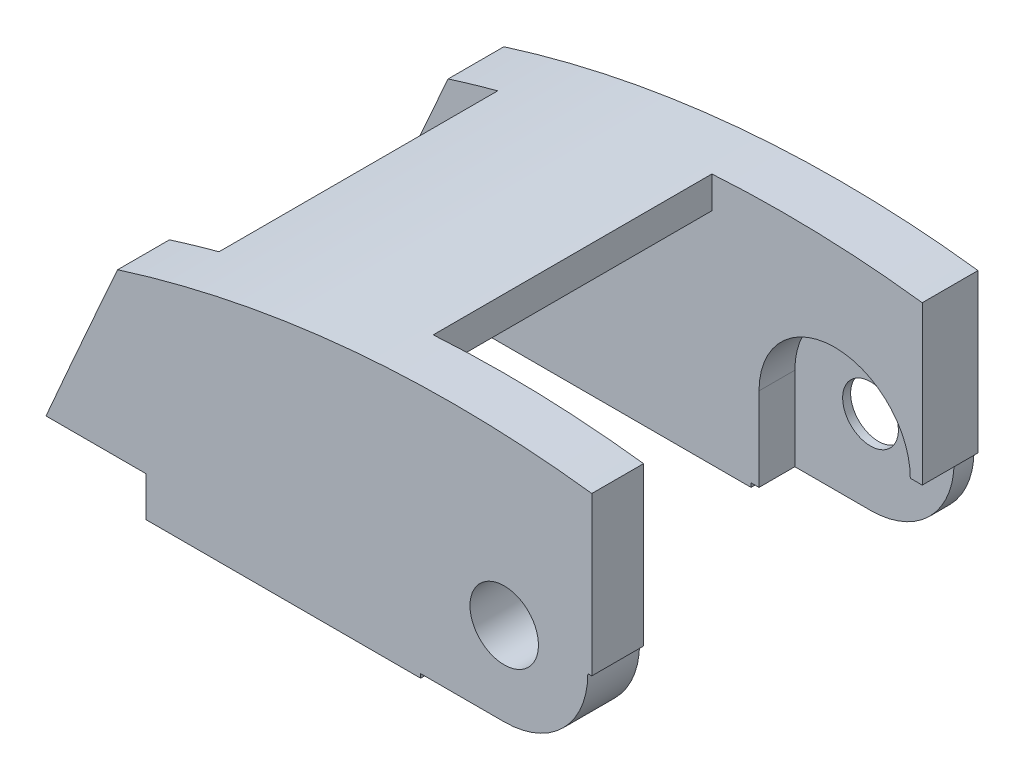
ISO-10303-21;
HEADER;
FILE_DESCRIPTION(('STEP AP214'),'2;1');
FILE_NAME('part.step','',(''),(''),'','','');
FILE_SCHEMA(('AUTOMOTIVE_DESIGN { 1 0 10303 214 1 1 1 1 }'));
ENDSEC;
DATA;
#1=APPLICATION_CONTEXT('core data for automotive mechanical design processes');
#2=APPLICATION_PROTOCOL_DEFINITION('international standard','automotive_design',2000,#1);
#3=PRODUCT_CONTEXT('',#1,'mechanical');
#4=PRODUCT('Part','Part','',(#3));
#5=PRODUCT_RELATED_PRODUCT_CATEGORY('part','',(#4));
#6=PRODUCT_DEFINITION_FORMATION('','',#4);
#7=PRODUCT_DEFINITION_CONTEXT('part definition',#1,'design');
#8=PRODUCT_DEFINITION('design','',#6,#7);
#9=PRODUCT_DEFINITION_SHAPE('','',#8);
#10=(LENGTH_UNIT() NAMED_UNIT(*) SI_UNIT(.MILLI.,.METRE.));
#11=(NAMED_UNIT(*) PLANE_ANGLE_UNIT() SI_UNIT($,.RADIAN.));
#12=(NAMED_UNIT(*) SI_UNIT($,.STERADIAN.) SOLID_ANGLE_UNIT());
#13=UNCERTAINTY_MEASURE_WITH_UNIT(LENGTH_MEASURE(1.E-05),#10,'distance_accuracy_value','');
#14=(GEOMETRIC_REPRESENTATION_CONTEXT(3) GLOBAL_UNCERTAINTY_ASSIGNED_CONTEXT((#13)) GLOBAL_UNIT_ASSIGNED_CONTEXT((#10,
#11,#12)) REPRESENTATION_CONTEXT('',''));
#15=CARTESIAN_POINT('',(0.,0.,0.));
#16=DIRECTION('',(0.,0.,1.));
#17=DIRECTION('',(1.,0.,0.));
#18=AXIS2_PLACEMENT_3D('',#15,#16,#17);
#19=CARTESIAN_POINT('',(0.,0.,21.75));
#20=DIRECTION('',(0.,0.,-1.));
#21=DIRECTION('',(-1.,0.,0.));
#22=AXIS2_PLACEMENT_3D('',#19,#20,#21);
#23=CYLINDRICAL_SURFACE('',#22,3.5);
#24=CARTESIAN_POINT('',(0.,0.,2.5));
#25=DIRECTION('',(0.,0.,1.));
#26=DIRECTION('',(0.,-1.,0.));
#27=AXIS2_PLACEMENT_3D('',#24,#25,#26);
#28=CIRCLE('',#27,3.5);
#29=CARTESIAN_POINT('',(0.,-3.5,2.5));
#30=VERTEX_POINT('',#29);
#31=EDGE_CURVE('E310',#30,#30,#28,.T.);
#32=ORIENTED_EDGE('',*,*,#31,.T.);
#33=EDGE_LOOP('',(#32));
#34=FACE_BOUND('',#33,.T.);
#35=CARTESIAN_POINT('',(0.,0.,1.5));
#36=DIRECTION('',(0.,0.,-1.));
#37=DIRECTION('',(-1.,0.,0.));
#38=AXIS2_PLACEMENT_3D('',#35,#36,#37);
#39=CIRCLE('',#38,3.5);
#40=CARTESIAN_POINT('',(-3.5,0.,1.5));
#41=VERTEX_POINT('',#40);
#42=EDGE_CURVE('E53',#41,#41,#39,.F.);
#43=ORIENTED_EDGE('',*,*,#42,.F.);
#44=EDGE_LOOP('',(#43));
#45=FACE_BOUND('',#44,.T.);
#46=ADVANCED_FACE('F49',(#34,#45),#23,.F.);
#47=CARTESIAN_POINT('',(12.,-12.,7.));
#48=DIRECTION('',(0.,0.,-1.));
#49=DIRECTION('',(0.,-1.,0.));
#50=AXIS2_PLACEMENT_3D('',#47,#48,#49);
#51=PLANE('',#50);
#52=CARTESIAN_POINT('',(0.,0.,7.));
#53=DIRECTION('',(0.,0.,-1.));
#54=DIRECTION('',(0.,1.,0.));
#55=AXIS2_PLACEMENT_3D('',#52,#53,#54);
#56=CIRCLE('',#55,9.5);
#57=CARTESIAN_POINT('',(-9.5,0.,7.));
#58=VERTEX_POINT('',#57);
#59=CARTESIAN_POINT('',(9.5,0.,7.));
#60=VERTEX_POINT('',#59);
#61=EDGE_CURVE('E537',#58,#60,#56,.T.);
#62=ORIENTED_EDGE('',*,*,#61,.T.);
#63=DIRECTION('',(-1.,0.,0.));
#64=VECTOR('',#63,1.);
#65=CARTESIAN_POINT('',(12.,0.,7.));
#66=LINE('',#65,#64);
#67=CARTESIAN_POINT('',(11.,0.,7.00000000000003));
#68=VERTEX_POINT('',#67);
#69=EDGE_CURVE('E382',#68,#60,#66,.T.);
#70=ORIENTED_EDGE('',*,*,#69,.F.);
#71=DIRECTION('',(0.,-1.,0.));
#72=VECTOR('',#71,1.);
#73=CARTESIAN_POINT('',(11.,-12.,7.));
#74=LINE('',#73,#72);
#75=CARTESIAN_POINT('',(11.,19.84,7.00000000000001));
#76=VERTEX_POINT('',#75);
#77=EDGE_CURVE('E532',#76,#68,#74,.T.);
#78=ORIENTED_EDGE('',*,*,#77,.F.);
#79=CARTESIAN_POINT('',(-6.37755228058483,-118.72612320149,7.00000000000001));
#80=DIRECTION('',(0.,0.,-1.));
#81=DIRECTION('',(-1.,0.,0.));
#82=AXIS2_PLACEMENT_3D('',#79,#80,#81);
#83=CIRCLE('',#82,139.651529967828);
#84=CARTESIAN_POINT('',(-15.4186813659914,20.6324352268174,7.00000000000001));
#85=VERTEX_POINT('',#84);
#86=EDGE_CURVE('E425',#76,#85,#83,.F.);
#87=ORIENTED_EDGE('',*,*,#86,.T.);
#88=DIRECTION('',(0.,1.,0.));
#89=VECTOR('',#88,1.);
#90=CARTESIAN_POINT('',(-15.4186813659914,25.0924741347079,7.));
#91=LINE('',#90,#89);
#92=CARTESIAN_POINT('',(-15.4186813659914,16.6302624928661,7.));
#93=VERTEX_POINT('',#92);
#94=EDGE_CURVE('E400',#93,#85,#91,.T.);
#95=ORIENTED_EDGE('',*,*,#94,.F.);
#96=CARTESIAN_POINT('',(-6.54760474938378,-90.7897246312211,6.99999999999999));
#97=DIRECTION('',(0.,0.,-1.));
#98=DIRECTION('',(0.,1.,0.));
#99=AXIS2_PLACEMENT_3D('',#96,#97,#98);
#100=CIRCLE('',#99,107.785665253209);
#101=CARTESIAN_POINT('',(-42.3185543882278,10.887159644469,7.));
#102=VERTEX_POINT('',#101);
#103=EDGE_CURVE('E449',#93,#102,#100,.F.);
#104=ORIENTED_EDGE('',*,*,#103,.T.);
#105=DIRECTION('',(0.,-1.,0.));
#106=VECTOR('',#105,1.);
#107=CARTESIAN_POINT('',(-42.3185543882278,23.1968454989127,7.));
#108=LINE('',#107,#106);
#109=CARTESIAN_POINT('',(-42.3185543882278,16.2212524300997,7.00000000000001));
#110=VERTEX_POINT('',#109);
#111=EDGE_CURVE('E395',#110,#102,#108,.T.);
#112=ORIENTED_EDGE('',*,*,#111,.F.);
#113=CARTESIAN_POINT('',(-6.37755228058483,-118.72612320149,7.00000000000001));
#114=DIRECTION('',(0.,0.,-1.));
#115=DIRECTION('',(-1.,0.,0.));
#116=AXIS2_PLACEMENT_3D('',#113,#114,#115);
#117=CIRCLE('',#116,139.651529967828);
#118=CARTESIAN_POINT('',(-48.5440000000004,14.4074206899005,7.));
#119=VERTEX_POINT('',#118);
#120=EDGE_CURVE('E414',#110,#119,#117,.F.);
#121=ORIENTED_EDGE('',*,*,#120,.T.);
#122=CARTESIAN_POINT('',(1474.51463993777,-669.474162441972,7.));
#123=DIRECTION('',(0.,0.,-1.));
#124=DIRECTION('',(-1.,0.,0.));
#125=AXIS2_PLACEMENT_3D('',#122,#123,#124);
#126=CIRCLE('',#125,1669.55132908098);
#127=CARTESIAN_POINT('',(-57.544,-6.00000000000001,7.));
#128=VERTEX_POINT('',#127);
#129=EDGE_CURVE('E550',#128,#119,#126,.T.);
#130=ORIENTED_EDGE('',*,*,#129,.F.);
#131=DIRECTION('',(-1.,0.,0.));
#132=VECTOR('',#131,1.);
#133=CARTESIAN_POINT('',(12.,-6.00000000000001,7.));
#134=LINE('',#133,#132);
#135=CARTESIAN_POINT('',(-45.,-6.00000000000001,7.));
#136=VERTEX_POINT('',#135);
#137=EDGE_CURVE('E497',#136,#128,#134,.T.);
#138=ORIENTED_EDGE('',*,*,#137,.F.);
#139=DIRECTION('',(0.,1.,0.));
#140=VECTOR('',#139,1.);
#141=CARTESIAN_POINT('',(-45.,-12.,7.));
#142=LINE('',#141,#140);
#143=CARTESIAN_POINT('',(-45.,-11.,6.99999999999999));
#144=VERTEX_POINT('',#143);
#145=EDGE_CURVE('E500',#144,#136,#142,.T.);
#146=ORIENTED_EDGE('',*,*,#145,.F.);
#147=DIRECTION('',(-1.,0.,0.));
#148=VECTOR('',#147,1.);
#149=CARTESIAN_POINT('',(0.,-11.,7.));
#150=LINE('',#149,#148);
#151=CARTESIAN_POINT('',(-10.5,-11.,7.00000000000001));
#152=VERTEX_POINT('',#151);
#153=EDGE_CURVE('E514',#152,#144,#150,.T.);
#154=ORIENTED_EDGE('',*,*,#153,.F.);
#155=DIRECTION('',(0.,-1.,0.));
#156=VECTOR('',#155,1.);
#157=CARTESIAN_POINT('',(-10.5,-12.,7.));
#158=LINE('',#157,#156);
#159=CARTESIAN_POINT('',(-10.5,-10.5,7.00000000000001));
#160=VERTEX_POINT('',#159);
#161=EDGE_CURVE('E389',#160,#152,#158,.T.);
#162=ORIENTED_EDGE('',*,*,#161,.F.);
#163=DIRECTION('',(-1.,0.,0.));
#164=VECTOR('',#163,1.);
#165=CARTESIAN_POINT('',(12.,-10.5,7.));
#166=LINE('',#165,#164);
#167=CARTESIAN_POINT('',(-9.5,-10.5,7.00000000000001));
#168=VERTEX_POINT('',#167);
#169=EDGE_CURVE('E392',#168,#160,#166,.T.);
#170=ORIENTED_EDGE('',*,*,#169,.F.);
#171=DIRECTION('',(0.,1.,0.));
#172=VECTOR('',#171,1.);
#173=CARTESIAN_POINT('',(-9.5,-12.,7.));
#174=LINE('',#173,#172);
#175=EDGE_CURVE('E322',#168,#58,#174,.T.);
#176=ORIENTED_EDGE('',*,*,#175,.T.);
#177=EDGE_LOOP('',(#62,#70,#78,#87,#95,#104,#112,#121,#130,#138,#146,#154,#162,#170,#176));
#178=FACE_BOUND('',#177,.T.);
#179=ADVANCED_FACE('F583',(#178),#51,.F.);
#180=CARTESIAN_POINT('',(0.,0.,0.));
#181=DIRECTION('',(0.,0.,-1.));
#182=DIRECTION('',(1.,0.,0.));
#183=AXIS2_PLACEMENT_3D('',#180,#181,#182);
#184=PLANE('',#183);
#185=CARTESIAN_POINT('',(0.,0.,0.));
#186=DIRECTION('',(0.,0.,-1.));
#187=DIRECTION('',(-1.,0.,0.));
#188=AXIS2_PLACEMENT_3D('',#185,#186,#187);
#189=CIRCLE('',#188,6.);
#190=CARTESIAN_POINT('',(0.,6.,0.));
#191=VERTEX_POINT('',#190);
#192=CARTESIAN_POINT('',(0.,-6.,0.));
#193=VERTEX_POINT('',#192);
#194=EDGE_CURVE('E67',#191,#193,#189,.T.);
#195=ORIENTED_EDGE('',*,*,#194,.F.);
#196=DIRECTION('',(1.,0.,0.));
#197=VECTOR('',#196,1.);
#198=CARTESIAN_POINT('',(0.,6.,0.));
#199=LINE('',#198,#197);
#200=CARTESIAN_POINT('',(-25.,6.,0.));
#201=VERTEX_POINT('',#200);
#202=EDGE_CURVE('E279',#201,#191,#199,.T.);
#203=ORIENTED_EDGE('',*,*,#202,.F.);
#204=DIRECTION('',(0.,1.,0.));
#205=VECTOR('',#204,1.);
#206=CARTESIAN_POINT('',(-25.,6.,0.));
#207=LINE('',#206,#205);
#208=CARTESIAN_POINT('',(-25.,-6.,0.));
#209=VERTEX_POINT('',#208);
#210=EDGE_CURVE('E283',#209,#201,#207,.T.);
#211=ORIENTED_EDGE('',*,*,#210,.F.);
#212=DIRECTION('',(-1.,0.,0.));
#213=VECTOR('',#212,1.);
#214=CARTESIAN_POINT('',(0.,-6.,0.));
#215=LINE('',#214,#213);
#216=EDGE_CURVE('E292',#193,#209,#215,.T.);
#217=ORIENTED_EDGE('',*,*,#216,.F.);
#218=EDGE_LOOP('',(#195,#203,#211,#217));
#219=FACE_BOUND('',#218,.T.);
#220=DIRECTION('',(-1.,0.,0.));
#221=VECTOR('',#220,1.);
#222=CARTESIAN_POINT('',(0.,-10.5,0.));
#223=LINE('',#222,#221);
#224=CARTESIAN_POINT('',(0.,-10.5,0.));
#225=VERTEX_POINT('',#224);
#226=CARTESIAN_POINT('',(-10.5,-10.5,0.));
#227=VERTEX_POINT('',#226);
#228=EDGE_CURVE('E335',#225,#227,#223,.T.);
#229=ORIENTED_EDGE('',*,*,#228,.T.);
#230=DIRECTION('',(0.,-1.,0.));
#231=VECTOR('',#230,1.);
#232=CARTESIAN_POINT('',(-10.5,0.,0.));
#233=LINE('',#232,#231);
#234=CARTESIAN_POINT('',(-10.5,-11.,0.));
#235=VERTEX_POINT('',#234);
#236=EDGE_CURVE('E353',#227,#235,#233,.T.);
#237=ORIENTED_EDGE('',*,*,#236,.T.);
#238=DIRECTION('',(-1.,0.,0.));
#239=VECTOR('',#238,1.);
#240=CARTESIAN_POINT('',(0.,-11.,0.));
#241=LINE('',#240,#239);
#242=CARTESIAN_POINT('',(-45.,-11.,0.));
#243=VERTEX_POINT('',#242);
#244=EDGE_CURVE('E513',#235,#243,#241,.T.);
#245=ORIENTED_EDGE('',*,*,#244,.T.);
#246=DIRECTION('',(0.,-1.,0.));
#247=VECTOR('',#246,1.);
#248=CARTESIAN_POINT('',(-45.,-11.,0.));
#249=LINE('',#248,#247);
#250=CARTESIAN_POINT('',(-45.,-6.00000000000001,0.));
#251=VERTEX_POINT('',#250);
#252=EDGE_CURVE('E474',#251,#243,#249,.T.);
#253=ORIENTED_EDGE('',*,*,#252,.F.);
#254=DIRECTION('',(1.,0.,0.));
#255=VECTOR('',#254,1.);
#256=CARTESIAN_POINT('',(-55.,-6.,0.));
#257=LINE('',#256,#255);
#258=CARTESIAN_POINT('',(-57.544,-6.00000000000001,0.));
#259=VERTEX_POINT('',#258);
#260=EDGE_CURVE('E471',#259,#251,#257,.T.);
#261=ORIENTED_EDGE('',*,*,#260,.F.);
#262=CARTESIAN_POINT('',(1474.51463993777,-669.474162441972,0.));
#263=DIRECTION('',(0.,0.,-1.));
#264=DIRECTION('',(-1.,0.,0.));
#265=AXIS2_PLACEMENT_3D('',#262,#263,#264);
#266=CIRCLE('',#265,1669.55132908098);
#267=CARTESIAN_POINT('',(-48.544,14.4074206899005,0.));
#268=VERTEX_POINT('',#267);
#269=EDGE_CURVE('E432',#268,#259,#266,.F.);
#270=ORIENTED_EDGE('',*,*,#269,.F.);
#271=CARTESIAN_POINT('',(-6.37755228058483,-118.72612320149,0.));
#272=DIRECTION('',(0.,0.,-1.));
#273=DIRECTION('',(-1.,0.,0.));
#274=AXIS2_PLACEMENT_3D('',#271,#272,#273);
#275=CIRCLE('',#274,139.651529967828);
#276=CARTESIAN_POINT('',(11.,19.84,0.));
#277=VERTEX_POINT('',#276);
#278=EDGE_CURVE('E466',#268,#277,#275,.T.);
#279=ORIENTED_EDGE('',*,*,#278,.T.);
#280=DIRECTION('',(0.,-1.,0.));
#281=VECTOR('',#280,1.);
#282=CARTESIAN_POINT('',(11.,0.,0.));
#283=LINE('',#282,#281);
#284=CARTESIAN_POINT('',(11.,0.,0.));
#285=VERTEX_POINT('',#284);
#286=EDGE_CURVE('E517',#277,#285,#283,.T.);
#287=ORIENTED_EDGE('',*,*,#286,.T.);
#288=DIRECTION('',(-1.,0.,0.));
#289=VECTOR('',#288,1.);
#290=CARTESIAN_POINT('',(0.,0.,0.));
#291=LINE('',#290,#289);
#292=CARTESIAN_POINT('',(10.5,0.,0.));
#293=VERTEX_POINT('',#292);
#294=EDGE_CURVE('E349',#285,#293,#291,.T.);
#295=ORIENTED_EDGE('',*,*,#294,.T.);
#296=CARTESIAN_POINT('',(0.,0.,0.));
#297=DIRECTION('',(0.,0.,-1.));
#298=DIRECTION('',(-1.,0.,0.));
#299=AXIS2_PLACEMENT_3D('',#296,#297,#298);
#300=CIRCLE('',#299,10.5);
#301=EDGE_CURVE('E345',#293,#225,#300,.T.);
#302=ORIENTED_EDGE('',*,*,#301,.T.);
#303=EDGE_LOOP('',(#229,#237,#245,#253,#261,#270,#279,#287,#295,#302));
#304=FACE_BOUND('',#303,.T.);
#305=ADVANCED_FACE('F590',(#219,#304),#184,.T.);
#306=CARTESIAN_POINT('',(0.,0.,48.5));
#307=DIRECTION('',(0.,0.,1.));
#308=DIRECTION('',(-1.,0.,0.));
#309=AXIS2_PLACEMENT_3D('',#306,#307,#308);
#310=PLANE('',#309);
#311=CARTESIAN_POINT('',(0.,0.,48.5));
#312=DIRECTION('',(0.,0.,-1.));
#313=DIRECTION('',(-1.,0.,0.));
#314=AXIS2_PLACEMENT_3D('',#311,#312,#313);
#315=CIRCLE('',#314,4.3);
#316=CARTESIAN_POINT('',(-4.3,0.,48.5));
#317=VERTEX_POINT('',#316);
#318=EDGE_CURVE('E326',#317,#317,#315,.T.);
#319=ORIENTED_EDGE('',*,*,#318,.T.);
#320=EDGE_LOOP('',(#319));
#321=FACE_BOUND('',#320,.T.);
#322=DIRECTION('',(-1.,0.,0.));
#323=VECTOR('',#322,1.);
#324=CARTESIAN_POINT('',(0.,-11.,48.5));
#325=LINE('',#324,#323);
#326=CARTESIAN_POINT('',(-10.5,-11.,48.5));
#327=VERTEX_POINT('',#326);
#328=CARTESIAN_POINT('',(-45.,-11.,48.5));
#329=VERTEX_POINT('',#328);
#330=EDGE_CURVE('E510',#327,#329,#325,.T.);
#331=ORIENTED_EDGE('',*,*,#330,.F.);
#332=DIRECTION('',(0.,-1.,0.));
#333=VECTOR('',#332,1.);
#334=CARTESIAN_POINT('',(-10.5,0.,48.5));
#335=LINE('',#334,#333);
#336=CARTESIAN_POINT('',(-10.5,-10.5,48.5));
#337=VERTEX_POINT('',#336);
#338=EDGE_CURVE('E338',#337,#327,#335,.T.);
#339=ORIENTED_EDGE('',*,*,#338,.F.);
#340=DIRECTION('',(-1.,0.,0.));
#341=VECTOR('',#340,1.);
#342=CARTESIAN_POINT('',(0.,-10.5,48.5));
#343=LINE('',#342,#341);
#344=CARTESIAN_POINT('',(0.,-10.5,48.5));
#345=VERTEX_POINT('',#344);
#346=EDGE_CURVE('E341',#345,#337,#343,.T.);
#347=ORIENTED_EDGE('',*,*,#346,.F.);
#348=CARTESIAN_POINT('',(0.,0.,48.5));
#349=DIRECTION('',(0.,0.,-1.));
#350=DIRECTION('',(-1.,0.,0.));
#351=AXIS2_PLACEMENT_3D('',#348,#349,#350);
#352=CIRCLE('',#351,10.5);
#353=CARTESIAN_POINT('',(10.5,0.,48.5));
#354=VERTEX_POINT('',#353);
#355=EDGE_CURVE('E331',#354,#345,#352,.T.);
#356=ORIENTED_EDGE('',*,*,#355,.F.);
#357=DIRECTION('',(-1.,0.,0.));
#358=VECTOR('',#357,1.);
#359=CARTESIAN_POINT('',(0.,0.,48.5));
#360=LINE('',#359,#358);
#361=CARTESIAN_POINT('',(11.,0.,48.5));
#362=VERTEX_POINT('',#361);
#363=EDGE_CURVE('E334',#362,#354,#360,.T.);
#364=ORIENTED_EDGE('',*,*,#363,.F.);
#365=DIRECTION('',(0.,-1.,0.));
#366=VECTOR('',#365,1.);
#367=CARTESIAN_POINT('',(11.,0.,48.5));
#368=LINE('',#367,#366);
#369=CARTESIAN_POINT('',(11.,19.84,48.5));
#370=VERTEX_POINT('',#369);
#371=EDGE_CURVE('E520',#370,#362,#368,.T.);
#372=ORIENTED_EDGE('',*,*,#371,.F.);
#373=CARTESIAN_POINT('',(-6.37755228058483,-118.72612320149,48.5));
#374=DIRECTION('',(0.,0.,1.));
#375=DIRECTION('',(1.,0.,0.));
#376=AXIS2_PLACEMENT_3D('',#373,#374,#375);
#377=CIRCLE('',#376,139.651529967828);
#378=CARTESIAN_POINT('',(-48.544,14.4074206899005,48.5));
#379=VERTEX_POINT('',#378);
#380=EDGE_CURVE('E463',#370,#379,#377,.T.);
#381=ORIENTED_EDGE('',*,*,#380,.T.);
#382=CARTESIAN_POINT('',(1474.51463993777,-669.474162441972,48.5));
#383=DIRECTION('',(0.,0.,-1.));
#384=DIRECTION('',(-1.,0.,0.));
#385=AXIS2_PLACEMENT_3D('',#382,#383,#384);
#386=CIRCLE('',#385,1669.55132908098);
#387=CARTESIAN_POINT('',(-57.544,-6.00000000000001,48.5));
#388=VERTEX_POINT('',#387);
#389=EDGE_CURVE('E436',#379,#388,#386,.F.);
#390=ORIENTED_EDGE('',*,*,#389,.T.);
#391=DIRECTION('',(1.,0.,0.));
#392=VECTOR('',#391,1.);
#393=CARTESIAN_POINT('',(-55.,-6.,48.5));
#394=LINE('',#393,#392);
#395=CARTESIAN_POINT('',(-45.,-6.00000000000001,48.5));
#396=VERTEX_POINT('',#395);
#397=EDGE_CURVE('E470',#388,#396,#394,.T.);
#398=ORIENTED_EDGE('',*,*,#397,.T.);
#399=DIRECTION('',(0.,-1.,0.));
#400=VECTOR('',#399,1.);
#401=CARTESIAN_POINT('',(-45.,-11.,48.5));
#402=LINE('',#401,#400);
#403=EDGE_CURVE('E475',#396,#329,#402,.T.);
#404=ORIENTED_EDGE('',*,*,#403,.T.);
#405=EDGE_LOOP('',(#331,#339,#347,#356,#364,#372,#381,#390,#398,#404));
#406=FACE_BOUND('',#405,.T.);
#407=ADVANCED_FACE('F660',(#321,#406),#310,.T.);
#408=CARTESIAN_POINT('',(0.,0.,42.));
#409=DIRECTION('',(0.,0.,-1.));
#410=DIRECTION('',(1.,0.,0.));
#411=AXIS2_PLACEMENT_3D('',#408,#409,#410);
#412=PLANE('',#411);
#413=CARTESIAN_POINT('',(0.,0.,42.));
#414=DIRECTION('',(0.,0.,-1.));
#415=DIRECTION('',(-1.,0.,0.));
#416=AXIS2_PLACEMENT_3D('',#413,#414,#415);
#417=CIRCLE('',#416,4.3);
#418=CARTESIAN_POINT('',(-4.3,0.,42.));
#419=VERTEX_POINT('',#418);
#420=EDGE_CURVE('E330',#419,#419,#417,.T.);
#421=ORIENTED_EDGE('',*,*,#420,.F.);
#422=EDGE_LOOP('',(#421));
#423=FACE_BOUND('',#422,.T.);
#424=DIRECTION('',(-1.,0.,0.));
#425=VECTOR('',#424,1.);
#426=CARTESIAN_POINT('',(0.,-10.5,42.));
#427=LINE('',#426,#425);
#428=CARTESIAN_POINT('',(0.,-10.5,42.));
#429=VERTEX_POINT('',#428);
#430=CARTESIAN_POINT('',(-10.5,-10.5,42.));
#431=VERTEX_POINT('',#430);
#432=EDGE_CURVE('E566',#429,#431,#427,.T.);
#433=ORIENTED_EDGE('',*,*,#432,.T.);
#434=DIRECTION('',(0.,-1.,0.));
#435=VECTOR('',#434,1.);
#436=CARTESIAN_POINT('',(-10.5,0.,42.));
#437=LINE('',#436,#435);
#438=CARTESIAN_POINT('',(-10.5,-11.,42.));
#439=VERTEX_POINT('',#438);
#440=EDGE_CURVE('E385',#431,#439,#437,.T.);
#441=ORIENTED_EDGE('',*,*,#440,.T.);
#442=DIRECTION('',(1.,0.,0.));
#443=VECTOR('',#442,1.);
#444=CARTESIAN_POINT('',(0.,-11.,42.));
#445=LINE('',#444,#443);
#446=CARTESIAN_POINT('',(-45.,-11.,42.));
#447=VERTEX_POINT('',#446);
#448=EDGE_CURVE('E506',#447,#439,#445,.T.);
#449=ORIENTED_EDGE('',*,*,#448,.F.);
#450=DIRECTION('',(0.,1.,0.));
#451=VECTOR('',#450,1.);
#452=CARTESIAN_POINT('',(-45.,0.,42.));
#453=LINE('',#452,#451);
#454=CARTESIAN_POINT('',(-45.,-6.00000000000001,42.));
#455=VERTEX_POINT('',#454);
#456=EDGE_CURVE('E541',#447,#455,#453,.T.);
#457=ORIENTED_EDGE('',*,*,#456,.T.);
#458=DIRECTION('',(-1.,0.,0.));
#459=VECTOR('',#458,1.);
#460=CARTESIAN_POINT('',(0.,-6.00000000000001,42.));
#461=LINE('',#460,#459);
#462=CARTESIAN_POINT('',(-57.544,-6.00000000000001,42.));
#463=VERTEX_POINT('',#462);
#464=EDGE_CURVE('E489',#455,#463,#461,.T.);
#465=ORIENTED_EDGE('',*,*,#464,.T.);
#466=CARTESIAN_POINT('',(1474.51463993777,-669.474162441972,42.));
#467=DIRECTION('',(0.,0.,-1.));
#468=DIRECTION('',(-1.,0.,0.));
#469=AXIS2_PLACEMENT_3D('',#466,#467,#468);
#470=CIRCLE('',#469,1669.55132908098);
#471=CARTESIAN_POINT('',(-48.5440000000004,14.4074206899005,42.));
#472=VERTEX_POINT('',#471);
#473=EDGE_CURVE('E547',#463,#472,#470,.T.);
#474=ORIENTED_EDGE('',*,*,#473,.T.);
#475=CARTESIAN_POINT('',(-6.37755228058483,-118.72612320149,42.));
#476=DIRECTION('',(0.,0.,-1.));
#477=DIRECTION('',(-1.,0.,0.));
#478=AXIS2_PLACEMENT_3D('',#475,#476,#477);
#479=CIRCLE('',#478,139.651529967828);
#480=CARTESIAN_POINT('',(-42.3185543882278,16.2212524300997,42.));
#481=VERTEX_POINT('',#480);
#482=EDGE_CURVE('E405',#481,#472,#479,.F.);
#483=ORIENTED_EDGE('',*,*,#482,.F.);
#484=DIRECTION('',(0.,-1.,0.));
#485=VECTOR('',#484,1.);
#486=CARTESIAN_POINT('',(-42.3185543882278,23.1968454989127,42.));
#487=LINE('',#486,#485);
#488=CARTESIAN_POINT('',(-42.3185543882278,10.887159644469,42.));
#489=VERTEX_POINT('',#488);
#490=EDGE_CURVE('E401',#481,#489,#487,.T.);
#491=ORIENTED_EDGE('',*,*,#490,.T.);
#492=CARTESIAN_POINT('',(-6.54760474938378,-90.7897246312211,42.));
#493=DIRECTION('',(0.,0.,-1.));
#494=DIRECTION('',(-1.,0.,0.));
#495=AXIS2_PLACEMENT_3D('',#492,#493,#494);
#496=CIRCLE('',#495,107.785665253209);
#497=CARTESIAN_POINT('',(-15.4186813659914,16.6302624928661,42.));
#498=VERTEX_POINT('',#497);
#499=EDGE_CURVE('E445',#498,#489,#496,.F.);
#500=ORIENTED_EDGE('',*,*,#499,.F.);
#501=DIRECTION('',(0.,1.,0.));
#502=VECTOR('',#501,1.);
#503=CARTESIAN_POINT('',(-15.4186813659914,25.0924741347079,42.));
#504=LINE('',#503,#502);
#505=CARTESIAN_POINT('',(-15.4186813659914,20.6324352268174,42.));
#506=VERTEX_POINT('',#505);
#507=EDGE_CURVE('E396',#498,#506,#504,.T.);
#508=ORIENTED_EDGE('',*,*,#507,.T.);
#509=CARTESIAN_POINT('',(-6.37755228058483,-118.72612320149,42.));
#510=DIRECTION('',(0.,0.,-1.));
#511=DIRECTION('',(-1.,0.,0.));
#512=AXIS2_PLACEMENT_3D('',#509,#510,#511);
#513=CIRCLE('',#512,139.651529967828);
#514=CARTESIAN_POINT('',(11.,19.84,42.));
#515=VERTEX_POINT('',#514);
#516=EDGE_CURVE('E421',#515,#506,#513,.F.);
#517=ORIENTED_EDGE('',*,*,#516,.F.);
#518=DIRECTION('',(0.,1.,0.));
#519=VECTOR('',#518,1.);
#520=CARTESIAN_POINT('',(11.,0.,42.));
#521=LINE('',#520,#519);
#522=CARTESIAN_POINT('',(11.,0.,42.));
#523=VERTEX_POINT('',#522);
#524=EDGE_CURVE('E503',#523,#515,#521,.T.);
#525=ORIENTED_EDGE('',*,*,#524,.F.);
#526=DIRECTION('',(-1.,0.,0.));
#527=VECTOR('',#526,1.);
#528=CARTESIAN_POINT('',(0.,0.,42.));
#529=LINE('',#528,#527);
#530=CARTESIAN_POINT('',(10.5,0.,42.));
#531=VERTEX_POINT('',#530);
#532=EDGE_CURVE('E364',#523,#531,#529,.T.);
#533=ORIENTED_EDGE('',*,*,#532,.T.);
#534=CARTESIAN_POINT('',(0.,0.,42.));
#535=DIRECTION('',(0.,0.,-1.));
#536=DIRECTION('',(-1.,0.,0.));
#537=AXIS2_PLACEMENT_3D('',#534,#535,#536);
#538=CIRCLE('',#537,10.5);
#539=EDGE_CURVE('E562',#531,#429,#538,.T.);
#540=ORIENTED_EDGE('',*,*,#539,.T.);
#541=EDGE_LOOP('',(#433,#441,#449,#457,#465,#474,#483,#491,#500,#508,#517,#525,#533,#540));
#542=FACE_BOUND('',#541,.T.);
#543=ADVANCED_FACE('F656',(#423,#542),#412,.T.);
#544=CARTESIAN_POINT('',(0.,-11.,7.));
#545=DIRECTION('',(0.,1.,0.));
#546=DIRECTION('',(-1.,0.,0.));
#547=AXIS2_PLACEMENT_3D('',#544,#545,#546);
#548=PLANE('',#547);
#549=DIRECTION('',(0.,0.,-1.));
#550=VECTOR('',#549,1.);
#551=CARTESIAN_POINT('',(-10.5,-11.,48.5));
#552=LINE('',#551,#550);
#553=EDGE_CURVE('E371',#327,#439,#552,.T.);
#554=ORIENTED_EDGE('',*,*,#553,.F.);
#555=ORIENTED_EDGE('',*,*,#330,.T.);
#556=DIRECTION('',(0.,0.,1.));
#557=VECTOR('',#556,1.);
#558=CARTESIAN_POINT('',(-45.,-11.,0.));
#559=LINE('',#558,#557);
#560=EDGE_CURVE('E490',#447,#329,#559,.T.);
#561=ORIENTED_EDGE('',*,*,#560,.F.);
#562=ORIENTED_EDGE('',*,*,#448,.T.);
#563=EDGE_LOOP('',(#554,#555,#561,#562));
#564=FACE_BOUND('',#563,.T.);
#565=ADVANCED_FACE('F659',(#564),#548,.F.);
#566=EDGE_CURVE('E374',#152,#235,#552,.T.);
#567=ORIENTED_EDGE('',*,*,#566,.F.);
#568=ORIENTED_EDGE('',*,*,#153,.T.);
#569=EDGE_CURVE('E485',#243,#144,#559,.T.);
#570=ORIENTED_EDGE('',*,*,#569,.F.);
#571=ORIENTED_EDGE('',*,*,#244,.F.);
#572=EDGE_LOOP('',(#567,#568,#570,#571));
#573=FACE_BOUND('',#572,.T.);
#574=ADVANCED_FACE('F664',(#573),#548,.F.);
#575=CARTESIAN_POINT('',(11.,0.,48.5));
#576=DIRECTION('',(-1.,0.,0.));
#577=DIRECTION('',(0.,0.,-1.));
#578=AXIS2_PLACEMENT_3D('',#575,#576,#577);
#579=PLANE('',#578);
#580=ORIENTED_EDGE('',*,*,#524,.T.);
#581=DIRECTION('',(0.,0.,-1.));
#582=VECTOR('',#581,1.);
#583=CARTESIAN_POINT('',(11.,19.84,214.866061332315));
#584=LINE('',#583,#582);
#585=EDGE_CURVE('E459',#370,#515,#584,.T.);
#586=ORIENTED_EDGE('',*,*,#585,.F.);
#587=ORIENTED_EDGE('',*,*,#371,.T.);
#588=DIRECTION('',(0.,0.,-1.));
#589=VECTOR('',#588,1.);
#590=CARTESIAN_POINT('',(11.,0.,48.5));
#591=LINE('',#590,#589);
#592=EDGE_CURVE('E528',#362,#523,#591,.T.);
#593=ORIENTED_EDGE('',*,*,#592,.T.);
#594=EDGE_LOOP('',(#580,#586,#587,#593));
#595=FACE_BOUND('',#594,.T.);
#596=ADVANCED_FACE('F670',(#595),#579,.F.);
#597=CARTESIAN_POINT('',(-55.,-6.,0.));
#598=DIRECTION('',(0.,1.,0.));
#599=DIRECTION('',(-1.,0.,0.));
#600=AXIS2_PLACEMENT_3D('',#597,#598,#599);
#601=PLANE('',#600);
#602=DIRECTION('',(0.,0.,-1.));
#603=VECTOR('',#602,1.);
#604=CARTESIAN_POINT('',(-57.544,-6.00000000000001,48.5));
#605=LINE('',#604,#603);
#606=EDGE_CURVE('E441',#388,#463,#605,.T.);
#607=ORIENTED_EDGE('',*,*,#606,.T.);
#608=ORIENTED_EDGE('',*,*,#464,.F.);
#609=DIRECTION('',(0.,0.,1.));
#610=VECTOR('',#609,1.);
#611=CARTESIAN_POINT('',(-45.,-6.00000000000001,0.));
#612=LINE('',#611,#610);
#613=EDGE_CURVE('E479',#455,#396,#612,.T.);
#614=ORIENTED_EDGE('',*,*,#613,.T.);
#615=ORIENTED_EDGE('',*,*,#397,.F.);
#616=EDGE_LOOP('',(#607,#608,#614,#615));
#617=FACE_BOUND('',#616,.T.);
#618=ADVANCED_FACE('F641',(#617),#601,.F.);
#619=CARTESIAN_POINT('',(-6.54760474938378,-90.7897246312211,48.5));
#620=DIRECTION('',(0.,0.,-1.));
#621=DIRECTION('',(-1.,0.,0.));
#622=AXIS2_PLACEMENT_3D('',#619,#620,#621);
#623=CYLINDRICAL_SURFACE('',#622,107.785665253209);
#624=ORIENTED_EDGE('',*,*,#103,.F.);
#625=DIRECTION('',(0.,0.,-1.));
#626=VECTOR('',#625,1.);
#627=CARTESIAN_POINT('',(-15.4186813659914,16.6302624928661,48.5));
#628=LINE('',#627,#626);
#629=EDGE_CURVE('E558',#93,#498,#628,.F.);
#630=ORIENTED_EDGE('',*,*,#629,.T.);
#631=ORIENTED_EDGE('',*,*,#499,.T.);
#632=DIRECTION('',(0.,0.,-1.));
#633=VECTOR('',#632,1.);
#634=CARTESIAN_POINT('',(-42.3185543882278,10.887159644469,48.5));
#635=LINE('',#634,#633);
#636=EDGE_CURVE('E554',#489,#102,#635,.T.);
#637=ORIENTED_EDGE('',*,*,#636,.T.);
#638=EDGE_LOOP('',(#624,#630,#631,#637));
#639=FACE_BOUND('',#638,.T.);
#640=ADVANCED_FACE('F638',(#639),#623,.F.);
#641=CARTESIAN_POINT('',(1474.51463993777,-669.474162441972,48.5));
#642=DIRECTION('',(0.,0.,-1.));
#643=DIRECTION('',(-1.,0.,0.));
#644=AXIS2_PLACEMENT_3D('',#641,#642,#643);
#645=CYLINDRICAL_SURFACE('',#644,1669.55132908098);
#646=ORIENTED_EDGE('',*,*,#473,.F.);
#647=ORIENTED_EDGE('',*,*,#606,.F.);
#648=ORIENTED_EDGE('',*,*,#389,.F.);
#649=DIRECTION('',(0.,0.,-1.));
#650=VECTOR('',#649,1.);
#651=CARTESIAN_POINT('',(-48.544,14.4074206899005,214.866061332315));
#652=LINE('',#651,#650);
#653=EDGE_CURVE('E454',#379,#472,#652,.T.);
#654=ORIENTED_EDGE('',*,*,#653,.T.);
#655=EDGE_LOOP('',(#646,#647,#648,#654));
#656=FACE_BOUND('',#655,.T.);
#657=ADVANCED_FACE('F637',(#656),#645,.T.);
#658=EDGE_CURVE('E458',#76,#277,#584,.T.);
#659=ORIENTED_EDGE('',*,*,#658,.F.);
#660=ORIENTED_EDGE('',*,*,#77,.T.);
#661=EDGE_CURVE('E524',#68,#285,#591,.T.);
#662=ORIENTED_EDGE('',*,*,#661,.T.);
#663=ORIENTED_EDGE('',*,*,#286,.F.);
#664=EDGE_LOOP('',(#659,#660,#662,#663));
#665=FACE_BOUND('',#664,.T.);
#666=ADVANCED_FACE('F666',(#665),#579,.F.);
#667=CARTESIAN_POINT('',(0.,0.,2.5));
#668=DIRECTION('',(0.,0.,1.));
#669=DIRECTION('',(0.,1.,0.));
#670=AXIS2_PLACEMENT_3D('',#667,#668,#669);
#671=PLANE('',#670);
#672=ORIENTED_EDGE('',*,*,#31,.F.);
#673=EDGE_LOOP('',(#672));
#674=FACE_BOUND('',#673,.T.);
#675=CARTESIAN_POINT('',(0.,0.,2.5));
#676=DIRECTION('',(0.,0.,-1.));
#677=DIRECTION('',(0.,1.,0.));
#678=AXIS2_PLACEMENT_3D('',#675,#676,#677);
#679=CIRCLE('',#678,9.5);
#680=CARTESIAN_POINT('',(-9.5,0.,2.5));
#681=VERTEX_POINT('',#680);
#682=CARTESIAN_POINT('',(9.5,0.,2.5));
#683=VERTEX_POINT('',#682);
#684=EDGE_CURVE('E536',#681,#683,#679,.T.);
#685=ORIENTED_EDGE('',*,*,#684,.F.);
#686=DIRECTION('',(0.,-1.,0.));
#687=VECTOR('',#686,1.);
#688=CARTESIAN_POINT('',(-9.5,0.,2.5));
#689=LINE('',#688,#687);
#690=CARTESIAN_POINT('',(-9.5,-10.5,2.5));
#691=VERTEX_POINT('',#690);
#692=EDGE_CURVE('E309',#681,#691,#689,.T.);
#693=ORIENTED_EDGE('',*,*,#692,.T.);
#694=DIRECTION('',(1.,0.,0.));
#695=VECTOR('',#694,1.);
#696=CARTESIAN_POINT('',(0.,-10.5,2.5));
#697=LINE('',#696,#695);
#698=CARTESIAN_POINT('',(0.,-10.5,2.50000000000002));
#699=VERTEX_POINT('',#698);
#700=EDGE_CURVE('E75',#691,#699,#697,.T.);
#701=ORIENTED_EDGE('',*,*,#700,.T.);
#702=CARTESIAN_POINT('',(0.,0.,2.5));
#703=DIRECTION('',(0.,0.,-1.));
#704=DIRECTION('',(-1.,0.,0.));
#705=AXIS2_PLACEMENT_3D('',#702,#703,#704);
#706=CIRCLE('',#705,10.5);
#707=CARTESIAN_POINT('',(10.5,0.,2.5));
#708=VERTEX_POINT('',#707);
#709=EDGE_CURVE('E59',#699,#708,#706,.F.);
#710=ORIENTED_EDGE('',*,*,#709,.T.);
#711=DIRECTION('',(-1.,0.,0.));
#712=VECTOR('',#711,1.);
#713=CARTESIAN_POINT('',(0.,0.,2.5));
#714=LINE('',#713,#712);
#715=EDGE_CURVE('E306',#708,#683,#714,.T.);
#716=ORIENTED_EDGE('',*,*,#715,.T.);
#717=EDGE_LOOP('',(#685,#693,#701,#710,#716));
#718=FACE_BOUND('',#717,.T.);
#719=ADVANCED_FACE('F51',(#674,#718),#671,.T.);
#720=CARTESIAN_POINT('',(0.,0.,2.5));
#721=DIRECTION('',(0.,0.,1.));
#722=DIRECTION('',(0.,1.,0.));
#723=AXIS2_PLACEMENT_3D('',#720,#721,#722);
#724=CYLINDRICAL_SURFACE('',#723,9.5);
#725=ORIENTED_EDGE('',*,*,#684,.T.);
#726=DIRECTION('',(0.,0.,1.));
#727=VECTOR('',#726,1.);
#728=CARTESIAN_POINT('',(9.5,0.,2.5));
#729=LINE('',#728,#727);
#730=EDGE_CURVE('E316',#683,#60,#729,.T.);
#731=ORIENTED_EDGE('',*,*,#730,.T.);
#732=ORIENTED_EDGE('',*,*,#61,.F.);
#733=DIRECTION('',(0.,0.,1.));
#734=VECTOR('',#733,1.);
#735=CARTESIAN_POINT('',(-9.5,0.,2.5));
#736=LINE('',#735,#734);
#737=EDGE_CURVE('E313',#681,#58,#736,.T.);
#738=ORIENTED_EDGE('',*,*,#737,.F.);
#739=EDGE_LOOP('',(#725,#731,#732,#738));
#740=FACE_BOUND('',#739,.T.);
#741=ADVANCED_FACE('F651',(#740),#724,.F.);
#742=CARTESIAN_POINT('',(-45.,-11.,0.));
#743=DIRECTION('',(1.,0.,0.));
#744=DIRECTION('',(0.,0.,1.));
#745=AXIS2_PLACEMENT_3D('',#742,#743,#744);
#746=PLANE('',#745);
#747=ORIENTED_EDGE('',*,*,#456,.F.);
#748=ORIENTED_EDGE('',*,*,#560,.T.);
#749=ORIENTED_EDGE('',*,*,#403,.F.);
#750=ORIENTED_EDGE('',*,*,#613,.F.);
#751=EDGE_LOOP('',(#747,#748,#749,#750));
#752=FACE_BOUND('',#751,.T.);
#753=ADVANCED_FACE('F647',(#752),#746,.F.);
#754=ORIENTED_EDGE('',*,*,#569,.T.);
#755=ORIENTED_EDGE('',*,*,#145,.T.);
#756=EDGE_CURVE('E491',#251,#136,#612,.T.);
#757=ORIENTED_EDGE('',*,*,#756,.F.);
#758=ORIENTED_EDGE('',*,*,#252,.T.);
#759=EDGE_LOOP('',(#754,#755,#757,#758));
#760=FACE_BOUND('',#759,.T.);
#761=ADVANCED_FACE('F650',(#760),#746,.F.);
#762=ORIENTED_EDGE('',*,*,#137,.T.);
#763=EDGE_CURVE('E440',#128,#259,#605,.T.);
#764=ORIENTED_EDGE('',*,*,#763,.T.);
#765=ORIENTED_EDGE('',*,*,#260,.T.);
#766=ORIENTED_EDGE('',*,*,#756,.T.);
#767=EDGE_LOOP('',(#762,#764,#765,#766));
#768=FACE_BOUND('',#767,.T.);
#769=ADVANCED_FACE('F645',(#768),#601,.F.);
#770=CARTESIAN_POINT('',(-6.37755228058483,-118.72612320149,214.866061332315));
#771=DIRECTION('',(0.,0.,-1.));
#772=DIRECTION('',(-1.,0.,0.));
#773=AXIS2_PLACEMENT_3D('',#770,#771,#772);
#774=CYLINDRICAL_SURFACE('',#773,139.651529967828);
#775=ORIENTED_EDGE('',*,*,#86,.F.);
#776=ORIENTED_EDGE('',*,*,#658,.T.);
#777=ORIENTED_EDGE('',*,*,#278,.F.);
#778=EDGE_CURVE('E453',#119,#268,#652,.T.);
#779=ORIENTED_EDGE('',*,*,#778,.F.);
#780=ORIENTED_EDGE('',*,*,#120,.F.);
#781=DIRECTION('',(0.,0.,-1.));
#782=VECTOR('',#781,1.);
#783=CARTESIAN_POINT('',(-42.3185543882278,16.2212524300997,214.866061332315));
#784=LINE('',#783,#782);
#785=EDGE_CURVE('E417',#110,#481,#784,.F.);
#786=ORIENTED_EDGE('',*,*,#785,.T.);
#787=ORIENTED_EDGE('',*,*,#482,.T.);
#788=ORIENTED_EDGE('',*,*,#653,.F.);
#789=ORIENTED_EDGE('',*,*,#380,.F.);
#790=ORIENTED_EDGE('',*,*,#585,.T.);
#791=ORIENTED_EDGE('',*,*,#516,.T.);
#792=DIRECTION('',(0.,0.,-1.));
#793=VECTOR('',#792,1.);
#794=CARTESIAN_POINT('',(-15.4186813659914,20.6324352268174,214.866061332315));
#795=LINE('',#794,#793);
#796=EDGE_CURVE('E428',#506,#85,#795,.T.);
#797=ORIENTED_EDGE('',*,*,#796,.T.);
#798=EDGE_LOOP('',(#775,#776,#777,#779,#780,#786,#787,#788,#789,#790,#791,#797));
#799=FACE_BOUND('',#798,.T.);
#800=ADVANCED_FACE('F635',(#799),#774,.T.);
#801=ORIENTED_EDGE('',*,*,#763,.F.);
#802=ORIENTED_EDGE('',*,*,#129,.T.);
#803=ORIENTED_EDGE('',*,*,#778,.T.);
#804=ORIENTED_EDGE('',*,*,#269,.T.);
#805=EDGE_LOOP('',(#801,#802,#803,#804));
#806=FACE_BOUND('',#805,.T.);
#807=ADVANCED_FACE('F631',(#806),#645,.T.);
#808=CARTESIAN_POINT('',(-42.3185543882278,23.1968454989127,7.));
#809=DIRECTION('',(-1.,0.,0.));
#810=DIRECTION('',(0.,0.,1.));
#811=AXIS2_PLACEMENT_3D('',#808,#809,#810);
#812=PLANE('',#811);
#813=ORIENTED_EDGE('',*,*,#111,.T.);
#814=ORIENTED_EDGE('',*,*,#636,.F.);
#815=ORIENTED_EDGE('',*,*,#490,.F.);
#816=ORIENTED_EDGE('',*,*,#785,.F.);
#817=EDGE_LOOP('',(#813,#814,#815,#816));
#818=FACE_BOUND('',#817,.T.);
#819=ADVANCED_FACE('F627',(#818),#812,.T.);
#820=CARTESIAN_POINT('',(-15.4186813659914,25.0924741347079,7.));
#821=DIRECTION('',(1.,0.,0.));
#822=DIRECTION('',(0.,0.,-1.));
#823=AXIS2_PLACEMENT_3D('',#820,#821,#822);
#824=PLANE('',#823);
#825=ORIENTED_EDGE('',*,*,#507,.F.);
#826=ORIENTED_EDGE('',*,*,#629,.F.);
#827=ORIENTED_EDGE('',*,*,#94,.T.);
#828=ORIENTED_EDGE('',*,*,#796,.F.);
#829=EDGE_LOOP('',(#825,#826,#827,#828));
#830=FACE_BOUND('',#829,.T.);
#831=ADVANCED_FACE('F624',(#830),#824,.T.);
#832=CARTESIAN_POINT('',(-10.5,0.,48.5));
#833=DIRECTION('',(1.,0.,0.));
#834=DIRECTION('',(0.,0.,-1.));
#835=AXIS2_PLACEMENT_3D('',#832,#833,#834);
#836=PLANE('',#835);
#837=ORIENTED_EDGE('',*,*,#161,.T.);
#838=ORIENTED_EDGE('',*,*,#566,.T.);
#839=ORIENTED_EDGE('',*,*,#236,.F.);
#840=DIRECTION('',(0.,0.,-1.));
#841=VECTOR('',#840,1.);
#842=CARTESIAN_POINT('',(-10.5,-10.5,48.5));
#843=LINE('',#842,#841);
#844=EDGE_CURVE('E370',#160,#227,#843,.T.);
#845=ORIENTED_EDGE('',*,*,#844,.F.);
#846=EDGE_LOOP('',(#837,#838,#839,#845));
#847=FACE_BOUND('',#846,.T.);
#848=ADVANCED_FACE('F615',(#847),#836,.T.);
#849=CARTESIAN_POINT('',(0.,-10.5,48.5));
#850=DIRECTION('',(0.,-1.,0.));
#851=DIRECTION('',(0.,0.,-1.));
#852=AXIS2_PLACEMENT_3D('',#849,#850,#851);
#853=PLANE('',#852);
#854=DIRECTION('',(0.,0.,-1.));
#855=VECTOR('',#854,1.);
#856=CARTESIAN_POINT('',(-9.5,-10.5,48.5));
#857=LINE('',#856,#855);
#858=EDGE_CURVE('E11',#168,#691,#857,.T.);
#859=ORIENTED_EDGE('',*,*,#858,.F.);
#860=ORIENTED_EDGE('',*,*,#169,.T.);
#861=ORIENTED_EDGE('',*,*,#844,.T.);
#862=ORIENTED_EDGE('',*,*,#228,.F.);
#863=DIRECTION('',(0.,0.,-1.));
#864=VECTOR('',#863,1.);
#865=CARTESIAN_POINT('',(0.,-10.5,48.5));
#866=LINE('',#865,#864);
#867=EDGE_CURVE('E365',#699,#225,#866,.T.);
#868=ORIENTED_EDGE('',*,*,#867,.F.);
#869=ORIENTED_EDGE('',*,*,#700,.F.);
#870=EDGE_LOOP('',(#859,#860,#861,#862,#868,#869));
#871=FACE_BOUND('',#870,.T.);
#872=ADVANCED_FACE('F611',(#871),#853,.T.);
#873=CARTESIAN_POINT('',(0.,0.,48.5));
#874=DIRECTION('',(0.,-1.,0.));
#875=DIRECTION('',(1.,0.,0.));
#876=AXIS2_PLACEMENT_3D('',#873,#874,#875);
#877=PLANE('',#876);
#878=ORIENTED_EDGE('',*,*,#294,.F.);
#879=ORIENTED_EDGE('',*,*,#661,.F.);
#880=ORIENTED_EDGE('',*,*,#69,.T.);
#881=ORIENTED_EDGE('',*,*,#730,.F.);
#882=ORIENTED_EDGE('',*,*,#715,.F.);
#883=DIRECTION('',(0.,0.,-1.));
#884=VECTOR('',#883,1.);
#885=CARTESIAN_POINT('',(10.5,0.,48.5));
#886=LINE('',#885,#884);
#887=EDGE_CURVE('E344',#708,#293,#886,.T.);
#888=ORIENTED_EDGE('',*,*,#887,.T.);
#889=EDGE_LOOP('',(#878,#879,#880,#881,#882,#888));
#890=FACE_BOUND('',#889,.T.);
#891=ADVANCED_FACE('F619',(#890),#877,.T.);
#892=CARTESIAN_POINT('',(0.,0.,48.5));
#893=DIRECTION('',(0.,0.,-1.));
#894=DIRECTION('',(-1.,0.,0.));
#895=AXIS2_PLACEMENT_3D('',#892,#893,#894);
#896=CYLINDRICAL_SURFACE('',#895,10.5);
#897=ORIENTED_EDGE('',*,*,#709,.F.);
#898=ORIENTED_EDGE('',*,*,#867,.T.);
#899=ORIENTED_EDGE('',*,*,#301,.F.);
#900=ORIENTED_EDGE('',*,*,#887,.F.);
#901=EDGE_LOOP('',(#897,#898,#899,#900));
#902=FACE_BOUND('',#901,.T.);
#903=ADVANCED_FACE('F622',(#902),#896,.T.);
#904=EDGE_CURVE('E375',#354,#531,#886,.T.);
#905=ORIENTED_EDGE('',*,*,#904,.F.);
#906=ORIENTED_EDGE('',*,*,#355,.T.);
#907=EDGE_CURVE('E360',#345,#429,#866,.T.);
#908=ORIENTED_EDGE('',*,*,#907,.T.);
#909=ORIENTED_EDGE('',*,*,#539,.F.);
#910=EDGE_LOOP('',(#905,#906,#908,#909));
#911=FACE_BOUND('',#910,.T.);
#912=ADVANCED_FACE('F609',(#911),#896,.T.);
#913=ORIENTED_EDGE('',*,*,#907,.F.);
#914=ORIENTED_EDGE('',*,*,#346,.T.);
#915=EDGE_CURVE('E366',#337,#431,#843,.T.);
#916=ORIENTED_EDGE('',*,*,#915,.T.);
#917=ORIENTED_EDGE('',*,*,#432,.F.);
#918=EDGE_LOOP('',(#913,#914,#916,#917));
#919=FACE_BOUND('',#918,.T.);
#920=ADVANCED_FACE('F605',(#919),#853,.T.);
#921=ORIENTED_EDGE('',*,*,#915,.F.);
#922=ORIENTED_EDGE('',*,*,#338,.T.);
#923=ORIENTED_EDGE('',*,*,#553,.T.);
#924=ORIENTED_EDGE('',*,*,#440,.F.);
#925=EDGE_LOOP('',(#921,#922,#923,#924));
#926=FACE_BOUND('',#925,.T.);
#927=ADVANCED_FACE('F608',(#926),#836,.T.);
#928=ORIENTED_EDGE('',*,*,#592,.F.);
#929=ORIENTED_EDGE('',*,*,#363,.T.);
#930=ORIENTED_EDGE('',*,*,#904,.T.);
#931=ORIENTED_EDGE('',*,*,#532,.F.);
#932=EDGE_LOOP('',(#928,#929,#930,#931));
#933=FACE_BOUND('',#932,.T.);
#934=ADVANCED_FACE('F603',(#933),#877,.T.);
#935=CARTESIAN_POINT('',(0.,0.,48.5));
#936=DIRECTION('',(0.,0.,-1.));
#937=DIRECTION('',(-1.,0.,0.));
#938=AXIS2_PLACEMENT_3D('',#935,#936,#937);
#939=CYLINDRICAL_SURFACE('',#938,4.3);
#940=CARTESIAN_POINT('',(-4.3,0.,42.));
#941=CARTESIAN_POINT('',(-4.3,0.,42.0677083333333));
#942=CARTESIAN_POINT('',(-4.3,0.,42.1354166666667));
#943=CARTESIAN_POINT('',(-4.3,0.,42.2708333333333));
#944=CARTESIAN_POINT('',(-4.3,0.,42.3385416666667));
#945=CARTESIAN_POINT('',(-4.3,0.,42.4739583333333));
#946=CARTESIAN_POINT('',(-4.3,0.,42.5416666666667));
#947=CARTESIAN_POINT('',(-4.3,0.,42.6770833333333));
#948=CARTESIAN_POINT('',(-4.3,0.,42.7447916666667));
#949=CARTESIAN_POINT('',(-4.3,0.,42.8802083333333));
#950=CARTESIAN_POINT('',(-4.3,0.,42.9479166666667));
#951=CARTESIAN_POINT('',(-4.3,0.,43.0833333333333));
#952=CARTESIAN_POINT('',(-4.3,0.,43.1510416666667));
#953=CARTESIAN_POINT('',(-4.3,0.,43.2864583333333));
#954=CARTESIAN_POINT('',(-4.3,0.,43.3541666666667));
#955=CARTESIAN_POINT('',(-4.3,0.,43.4895833333333));
#956=CARTESIAN_POINT('',(-4.3,0.,43.5572916666667));
#957=CARTESIAN_POINT('',(-4.3,0.,43.6927083333333));
#958=CARTESIAN_POINT('',(-4.3,0.,43.7604166666667));
#959=CARTESIAN_POINT('',(-4.3,0.,43.8958333333333));
#960=CARTESIAN_POINT('',(-4.3,0.,43.9635416666667));
#961=CARTESIAN_POINT('',(-4.3,0.,44.0989583333333));
#962=CARTESIAN_POINT('',(-4.3,0.,44.1666666666667));
#963=CARTESIAN_POINT('',(-4.3,0.,44.3020833333333));
#964=CARTESIAN_POINT('',(-4.3,0.,44.3697916666667));
#965=CARTESIAN_POINT('',(-4.3,0.,44.5052083333333));
#966=CARTESIAN_POINT('',(-4.3,0.,44.5729166666667));
#967=CARTESIAN_POINT('',(-4.3,0.,44.7083333333333));
#968=CARTESIAN_POINT('',(-4.3,0.,44.7760416666667));
#969=CARTESIAN_POINT('',(-4.3,0.,44.9114583333333));
#970=CARTESIAN_POINT('',(-4.3,0.,44.9791666666667));
#971=CARTESIAN_POINT('',(-4.3,0.,45.1145833333333));
#972=CARTESIAN_POINT('',(-4.3,0.,45.1822916666667));
#973=CARTESIAN_POINT('',(-4.3,0.,45.3177083333333));
#974=CARTESIAN_POINT('',(-4.3,0.,45.3854166666667));
#975=CARTESIAN_POINT('',(-4.3,0.,45.5208333333333));
#976=CARTESIAN_POINT('',(-4.3,0.,45.5885416666667));
#977=CARTESIAN_POINT('',(-4.3,0.,45.7239583333333));
#978=CARTESIAN_POINT('',(-4.3,0.,45.7916666666667));
#979=CARTESIAN_POINT('',(-4.3,0.,45.9270833333333));
#980=CARTESIAN_POINT('',(-4.3,0.,45.9947916666667));
#981=CARTESIAN_POINT('',(-4.3,0.,46.1302083333333));
#982=CARTESIAN_POINT('',(-4.3,0.,46.1979166666667));
#983=CARTESIAN_POINT('',(-4.3,0.,46.3333333333333));
#984=CARTESIAN_POINT('',(-4.3,0.,46.4010416666667));
#985=CARTESIAN_POINT('',(-4.3,0.,46.5364583333333));
#986=CARTESIAN_POINT('',(-4.3,0.,46.6041666666667));
#987=CARTESIAN_POINT('',(-4.3,0.,46.7395833333333));
#988=CARTESIAN_POINT('',(-4.3,0.,46.8072916666667));
#989=CARTESIAN_POINT('',(-4.3,0.,46.9427083333333));
#990=CARTESIAN_POINT('',(-4.3,0.,47.0104166666667));
#991=CARTESIAN_POINT('',(-4.3,0.,47.1458333333333));
#992=CARTESIAN_POINT('',(-4.3,0.,47.2135416666667));
#993=CARTESIAN_POINT('',(-4.3,0.,47.3489583333333));
#994=CARTESIAN_POINT('',(-4.3,0.,47.4166666666667));
#995=CARTESIAN_POINT('',(-4.3,0.,47.5520833333333));
#996=CARTESIAN_POINT('',(-4.3,0.,47.6197916666667));
#997=CARTESIAN_POINT('',(-4.3,0.,47.7552083333333));
#998=CARTESIAN_POINT('',(-4.3,0.,47.8229166666667));
#999=CARTESIAN_POINT('',(-4.3,0.,47.9583333333333));
#1000=CARTESIAN_POINT('',(-4.3,0.,48.0260416666667));
#1001=CARTESIAN_POINT('',(-4.3,0.,48.1614583333333));
#1002=CARTESIAN_POINT('',(-4.3,0.,48.2291666666667));
#1003=CARTESIAN_POINT('',(-4.3,0.,48.3645833333333));
#1004=CARTESIAN_POINT('',(-4.3,0.,48.4322916666667));
#1005=CARTESIAN_POINT('',(-4.3,0.,48.5));
#1006=B_SPLINE_CURVE_WITH_KNOTS('',3,(#940,#941,#942,#943,#944,#945,#946,#947,#948,#949,#950,
#951,#952,#953,#954,#955,#956,#957,#958,#959,#960,#961,#962,#963,#964,#965,#966,#967,#968,#969,
#970,#971,#972,#973,#974,#975,#976,#977,#978,#979,#980,#981,#982,#983,#984,#985,#986,#987,#988,
#989,#990,#991,#992,#993,#994,#995,#996,#997,#998,#999,#1000,#1001,#1002,#1003,#1004,#1005),
.UNSPECIFIED.,.F.,.F.,(4,2,2,2,2,2,2,2,2,2,2,2,2,2,2,2,2,2,2,2,2,2,2,2,2,2,2,2,2,2,2,2,4),(0.,
0.203125000000005,0.406250000000004,0.609375000000002,0.812500000000001,1.015625,1.21875,
1.421875,1.625,1.828125,2.03125000000001,2.234375,2.4375,2.640625,2.84375,3.046875,3.25,
3.453125,3.65625,3.85937500000001,4.0625,4.265625,4.46875,4.67187500000001,4.875,5.078125,
5.28125,5.484375,5.68750000000001,5.890625,6.09375,6.296875,6.5),.UNSPECIFIED.);
#1007=EDGE_CURVE('BSEAM599',#419,#317,#1006,.T.);
#1008=ORIENTED_EDGE('',*,*,#420,.T.);
#1009=ORIENTED_EDGE('',*,*,#318,.F.);
#1010=ORIENTED_EDGE('',*,*,#1007,.T.);
#1011=ORIENTED_EDGE('',*,*,#1007,.F.);
#1012=EDGE_LOOP('',(#1008,#1010,#1009,#1011));
#1013=FACE_BOUND('',#1012,.T.);
#1014=ADVANCED_FACE('F599',(#1013),#939,.F.);
#1015=CARTESIAN_POINT('',(-9.5,0.,2.5));
#1016=DIRECTION('',(-1.,0.,0.));
#1017=DIRECTION('',(0.,0.,1.));
#1018=AXIS2_PLACEMENT_3D('',#1015,#1016,#1017);
#1019=PLANE('',#1018);
#1020=ORIENTED_EDGE('',*,*,#858,.T.);
#1021=ORIENTED_EDGE('',*,*,#692,.F.);
#1022=ORIENTED_EDGE('',*,*,#737,.T.);
#1023=ORIENTED_EDGE('',*,*,#175,.F.);
#1024=EDGE_LOOP('',(#1020,#1021,#1022,#1023));
#1025=FACE_BOUND('',#1024,.T.);
#1026=ADVANCED_FACE('F596',(#1025),#1019,.F.);
#1027=CARTESIAN_POINT('',(0.,0.,1.5));
#1028=DIRECTION('',(0.,0.,-1.));
#1029=DIRECTION('',(-1.,0.,0.));
#1030=AXIS2_PLACEMENT_3D('',#1027,#1028,#1029);
#1031=PLANE('',#1030);
#1032=CARTESIAN_POINT('',(0.,0.,1.5));
#1033=DIRECTION('',(0.,0.,-1.));
#1034=DIRECTION('',(-1.,0.,0.));
#1035=AXIS2_PLACEMENT_3D('',#1032,#1033,#1034);
#1036=CIRCLE('',#1035,6.);
#1037=CARTESIAN_POINT('',(0.,6.,1.5));
#1038=VERTEX_POINT('',#1037);
#1039=CARTESIAN_POINT('',(0.,-6.,1.5));
#1040=VERTEX_POINT('',#1039);
#1041=EDGE_CURVE('E257',#1038,#1040,#1036,.T.);
#1042=ORIENTED_EDGE('',*,*,#1041,.T.);
#1043=DIRECTION('',(-1.,0.,0.));
#1044=VECTOR('',#1043,1.);
#1045=CARTESIAN_POINT('',(0.,-6.,1.5));
#1046=LINE('',#1045,#1044);
#1047=CARTESIAN_POINT('',(-25.,-6.,1.5));
#1048=VERTEX_POINT('',#1047);
#1049=EDGE_CURVE('E267',#1040,#1048,#1046,.T.);
#1050=ORIENTED_EDGE('',*,*,#1049,.T.);
#1051=DIRECTION('',(0.,1.,0.));
#1052=VECTOR('',#1051,1.);
#1053=CARTESIAN_POINT('',(-25.,6.,1.5));
#1054=LINE('',#1053,#1052);
#1055=CARTESIAN_POINT('',(-25.,6.,1.5));
#1056=VERTEX_POINT('',#1055);
#1057=EDGE_CURVE('E273',#1048,#1056,#1054,.T.);
#1058=ORIENTED_EDGE('',*,*,#1057,.T.);
#1059=DIRECTION('',(1.,0.,0.));
#1060=VECTOR('',#1059,1.);
#1061=CARTESIAN_POINT('',(0.,6.,1.5));
#1062=LINE('',#1061,#1060);
#1063=EDGE_CURVE('E264',#1056,#1038,#1062,.T.);
#1064=ORIENTED_EDGE('',*,*,#1063,.T.);
#1065=EDGE_LOOP('',(#1042,#1050,#1058,#1064));
#1066=FACE_BOUND('',#1065,.T.);
#1067=ORIENTED_EDGE('',*,*,#42,.T.);
#1068=EDGE_LOOP('',(#1067));
#1069=FACE_BOUND('',#1068,.T.);
#1070=ADVANCED_FACE('F275',(#1066,#1069),#1031,.T.);
#1071=CARTESIAN_POINT('',(0.,0.,1.5));
#1072=DIRECTION('',(0.,0.,-1.));
#1073=DIRECTION('',(-1.,0.,0.));
#1074=AXIS2_PLACEMENT_3D('',#1071,#1072,#1073);
#1075=CYLINDRICAL_SURFACE('',#1074,6.);
#1076=ORIENTED_EDGE('',*,*,#194,.T.);
#1077=DIRECTION('',(0.,0.,-1.));
#1078=VECTOR('',#1077,1.);
#1079=CARTESIAN_POINT('',(0.,-6.,1.5));
#1080=LINE('',#1079,#1078);
#1081=EDGE_CURVE('E253',#1040,#193,#1080,.T.);
#1082=ORIENTED_EDGE('',*,*,#1081,.F.);
#1083=ORIENTED_EDGE('',*,*,#1041,.F.);
#1084=DIRECTION('',(0.,0.,-1.));
#1085=VECTOR('',#1084,1.);
#1086=CARTESIAN_POINT('',(0.,6.,1.5));
#1087=LINE('',#1086,#1085);
#1088=EDGE_CURVE('E298',#1038,#191,#1087,.T.);
#1089=ORIENTED_EDGE('',*,*,#1088,.T.);
#1090=EDGE_LOOP('',(#1076,#1082,#1083,#1089));
#1091=FACE_BOUND('',#1090,.T.);
#1092=ADVANCED_FACE('F255',(#1091),#1075,.F.);
#1093=CARTESIAN_POINT('',(0.,6.,1.5));
#1094=DIRECTION('',(0.,1.,0.));
#1095=DIRECTION('',(0.,0.,1.));
#1096=AXIS2_PLACEMENT_3D('',#1093,#1094,#1095);
#1097=PLANE('',#1096);
#1098=ORIENTED_EDGE('',*,*,#202,.T.);
#1099=ORIENTED_EDGE('',*,*,#1088,.F.);
#1100=ORIENTED_EDGE('',*,*,#1063,.F.);
#1101=DIRECTION('',(0.,0.,-1.));
#1102=VECTOR('',#1101,1.);
#1103=CARTESIAN_POINT('',(-25.,6.,1.5));
#1104=LINE('',#1103,#1102);
#1105=EDGE_CURVE('E301',#1056,#201,#1104,.T.);
#1106=ORIENTED_EDGE('',*,*,#1105,.T.);
#1107=EDGE_LOOP('',(#1098,#1099,#1100,#1106));
#1108=FACE_BOUND('',#1107,.T.);
#1109=ADVANCED_FACE('F1026',(#1108),#1097,.F.);
#1110=CARTESIAN_POINT('',(-25.,6.,1.5));
#1111=DIRECTION('',(-1.,0.,0.));
#1112=DIRECTION('',(0.,0.,1.));
#1113=AXIS2_PLACEMENT_3D('',#1110,#1111,#1112);
#1114=PLANE('',#1113);
#1115=ORIENTED_EDGE('',*,*,#210,.T.);
#1116=ORIENTED_EDGE('',*,*,#1105,.F.);
#1117=ORIENTED_EDGE('',*,*,#1057,.F.);
#1118=DIRECTION('',(0.,0.,-1.));
#1119=VECTOR('',#1118,1.);
#1120=CARTESIAN_POINT('',(-25.,-6.,1.5));
#1121=LINE('',#1120,#1119);
#1122=EDGE_CURVE('E263',#1048,#209,#1121,.T.);
#1123=ORIENTED_EDGE('',*,*,#1122,.T.);
#1124=EDGE_LOOP('',(#1115,#1116,#1117,#1123));
#1125=FACE_BOUND('',#1124,.T.);
#1126=ADVANCED_FACE('F1033',(#1125),#1114,.F.);
#1127=CARTESIAN_POINT('',(0.,-6.,1.5));
#1128=DIRECTION('',(0.,-1.,0.));
#1129=DIRECTION('',(0.,0.,-1.));
#1130=AXIS2_PLACEMENT_3D('',#1127,#1128,#1129);
#1131=PLANE('',#1130);
#1132=ORIENTED_EDGE('',*,*,#216,.T.);
#1133=ORIENTED_EDGE('',*,*,#1122,.F.);
#1134=ORIENTED_EDGE('',*,*,#1049,.F.);
#1135=ORIENTED_EDGE('',*,*,#1081,.T.);
#1136=EDGE_LOOP('',(#1132,#1133,#1134,#1135));
#1137=FACE_BOUND('',#1136,.T.);
#1138=ADVANCED_FACE('F268',(#1137),#1131,.F.);
#1139=CLOSED_SHELL('',(#46,#179,#305,#407,#543,#565,#574,#596,#618,#640,#657,#666,#719,#741,
#753,#761,#769,#800,#807,#819,#831,#848,#872,#891,#903,#912,#920,#927,#934,#1014,#1026,#1070,
#1092,#1109,#1126,#1138));
#1140=MANIFOLD_SOLID_BREP('B2',#1139);
#1141=ADVANCED_BREP_SHAPE_REPRESENTATION('',(#18,#1140),#14);
#1142=SHAPE_DEFINITION_REPRESENTATION(#9,#1141);
ENDSEC;
END-ISO-10303-21;
